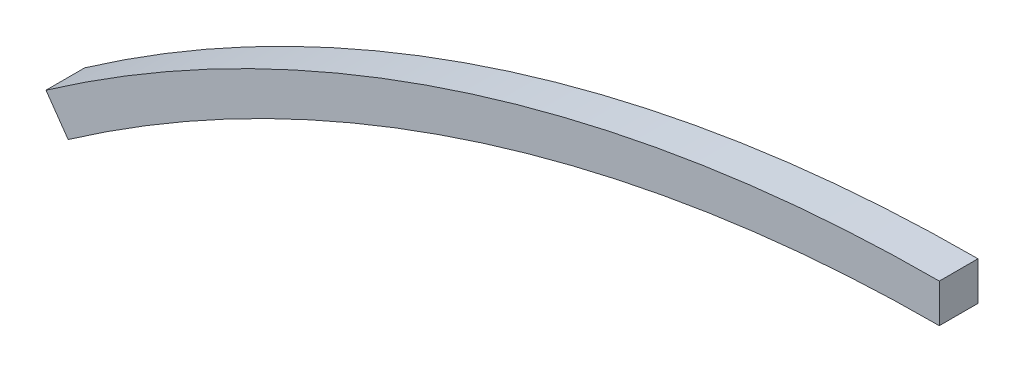
ISO-10303-21;
HEADER;
FILE_DESCRIPTION(('STEP AP214'),'2;1');
FILE_NAME('part.step','',(''),(''),'','','');
FILE_SCHEMA(('AUTOMOTIVE_DESIGN { 1 0 10303 214 1 1 1 1 }'));
ENDSEC;
DATA;
#1=APPLICATION_CONTEXT('core data for automotive mechanical design processes');
#2=APPLICATION_PROTOCOL_DEFINITION('international standard','automotive_design',2000,#1);
#3=PRODUCT_CONTEXT('',#1,'mechanical');
#4=PRODUCT('Part','Part','',(#3));
#5=PRODUCT_RELATED_PRODUCT_CATEGORY('part','',(#4));
#6=PRODUCT_DEFINITION_FORMATION('','',#4);
#7=PRODUCT_DEFINITION_CONTEXT('part definition',#1,'design');
#8=PRODUCT_DEFINITION('design','',#6,#7);
#9=PRODUCT_DEFINITION_SHAPE('','',#8);
#10=(LENGTH_UNIT() NAMED_UNIT(*) SI_UNIT(.MILLI.,.METRE.));
#11=(NAMED_UNIT(*) PLANE_ANGLE_UNIT() SI_UNIT($,.RADIAN.));
#12=(NAMED_UNIT(*) SI_UNIT($,.STERADIAN.) SOLID_ANGLE_UNIT());
#13=UNCERTAINTY_MEASURE_WITH_UNIT(LENGTH_MEASURE(1.E-05),#10,'distance_accuracy_value','');
#14=(GEOMETRIC_REPRESENTATION_CONTEXT(3) GLOBAL_UNCERTAINTY_ASSIGNED_CONTEXT((#13)) GLOBAL_UNIT_ASSIGNED_CONTEXT((#10,
#11,#12)) REPRESENTATION_CONTEXT('',''));
#15=CARTESIAN_POINT('',(0.,0.,0.));
#16=DIRECTION('',(0.,0.,1.));
#17=DIRECTION('',(1.,0.,0.));
#18=AXIS2_PLACEMENT_3D('',#15,#16,#17);
#19=CARTESIAN_POINT('',(0.,0.,2.));
#20=DIRECTION('',(0.,0.,-1.));
#21=DIRECTION('',(-1.,0.,0.));
#22=AXIS2_PLACEMENT_3D('',#19,#20,#21);
#23=CYLINDRICAL_SURFACE('',#22,78.6359913793104);
#24=CARTESIAN_POINT('',(0.,0.,0.));
#25=DIRECTION('',(0.,0.,-1.));
#26=DIRECTION('',(1.,0.,0.));
#27=AXIS2_PLACEMENT_3D('',#24,#25,#26);
#28=CIRCLE('',#27,78.6359913793104);
#29=CARTESIAN_POINT('',(-45.0615439363453,64.4443666915875,0.));
#30=VERTEX_POINT('',#29);
#31=CARTESIAN_POINT('',(0.,78.6359913793104,0.));
#32=VERTEX_POINT('',#31);
#33=EDGE_CURVE('E96',#30,#32,#28,.T.);
#34=ORIENTED_EDGE('',*,*,#33,.T.);
#35=DIRECTION('',(0.,0.,-1.));
#36=VECTOR('',#35,1.);
#37=CARTESIAN_POINT('',(0.,78.6359913793104,2.));
#38=LINE('',#37,#36);
#39=CARTESIAN_POINT('',(0.,78.6359913793104,2.));
#40=VERTEX_POINT('',#39);
#41=EDGE_CURVE('E11',#40,#32,#38,.T.);
#42=ORIENTED_EDGE('',*,*,#41,.F.);
#43=CARTESIAN_POINT('',(0.,0.,2.));
#44=DIRECTION('',(0.,0.,-1.));
#45=DIRECTION('',(1.,0.,0.));
#46=AXIS2_PLACEMENT_3D('',#43,#44,#45);
#47=CIRCLE('',#46,78.6359913793104);
#48=CARTESIAN_POINT('',(-45.0615439363453,64.4443666915875,2.));
#49=VERTEX_POINT('',#48);
#50=EDGE_CURVE('E84',#49,#40,#47,.T.);
#51=ORIENTED_EDGE('',*,*,#50,.F.);
#52=DIRECTION('',(0.,0.,-1.));
#53=VECTOR('',#52,1.);
#54=CARTESIAN_POINT('',(-45.0615439363453,64.4443666915875,2.));
#55=LINE('',#54,#53);
#56=EDGE_CURVE('E92',#49,#30,#55,.T.);
#57=ORIENTED_EDGE('',*,*,#56,.T.);
#58=EDGE_LOOP('',(#34,#42,#51,#57));
#59=FACE_BOUND('',#58,.T.);
#60=ADVANCED_FACE('F33',(#59),#23,.F.);
#61=CARTESIAN_POINT('',(0.,78.6359913793104,2.));
#62=DIRECTION('',(-1.,0.,0.));
#63=DIRECTION('',(0.,-1.,0.));
#64=AXIS2_PLACEMENT_3D('',#61,#62,#63);
#65=PLANE('',#64);
#66=DIRECTION('',(0.,1.,0.));
#67=VECTOR('',#66,1.);
#68=CARTESIAN_POINT('',(0.,78.6359913793104,0.));
#69=LINE('',#68,#67);
#70=CARTESIAN_POINT('',(0.,80.6359913793104,0.));
#71=VERTEX_POINT('',#70);
#72=EDGE_CURVE('E88',#32,#71,#69,.T.);
#73=ORIENTED_EDGE('',*,*,#72,.T.);
#74=DIRECTION('',(0.,0.,-1.));
#75=VECTOR('',#74,1.);
#76=CARTESIAN_POINT('',(0.,80.6359913793104,2.));
#77=LINE('',#76,#75);
#78=CARTESIAN_POINT('',(0.,80.6359913793104,2.));
#79=VERTEX_POINT('',#78);
#80=EDGE_CURVE('E41',#79,#71,#77,.T.);
#81=ORIENTED_EDGE('',*,*,#80,.F.);
#82=DIRECTION('',(0.,1.,0.));
#83=VECTOR('',#82,1.);
#84=CARTESIAN_POINT('',(0.,78.6359913793104,2.));
#85=LINE('',#84,#83);
#86=EDGE_CURVE('E79',#40,#79,#85,.T.);
#87=ORIENTED_EDGE('',*,*,#86,.F.);
#88=ORIENTED_EDGE('',*,*,#41,.T.);
#89=EDGE_LOOP('',(#73,#81,#87,#88));
#90=FACE_BOUND('',#89,.T.);
#91=ADVANCED_FACE('F87',(#90),#65,.F.);
#92=CARTESIAN_POINT('',(0.,0.,2.));
#93=DIRECTION('',(0.,0.,-1.));
#94=DIRECTION('',(-1.,0.,0.));
#95=AXIS2_PLACEMENT_3D('',#92,#93,#94);
#96=CYLINDRICAL_SURFACE('',#95,80.6359913793104);
#97=CARTESIAN_POINT('',(0.,0.,0.));
#98=DIRECTION('',(0.,0.,1.));
#99=DIRECTION('',(1.,0.,0.));
#100=AXIS2_PLACEMENT_3D('',#97,#98,#99);
#101=CIRCLE('',#100,80.6359913793104);
#102=CARTESIAN_POINT('',(-46.207623311602,66.0834219272679,0.));
#103=VERTEX_POINT('',#102);
#104=EDGE_CURVE('E66',#71,#103,#101,.T.);
#105=ORIENTED_EDGE('',*,*,#104,.T.);
#106=DIRECTION('',(0.,0.,-1.));
#107=VECTOR('',#106,1.);
#108=CARTESIAN_POINT('',(-46.207623311602,66.0834219272679,2.));
#109=LINE('',#108,#107);
#110=CARTESIAN_POINT('',(-46.207623311602,66.0834219272679,2.));
#111=VERTEX_POINT('',#110);
#112=EDGE_CURVE('E89',#111,#103,#109,.T.);
#113=ORIENTED_EDGE('',*,*,#112,.F.);
#114=CARTESIAN_POINT('',(0.,0.,2.));
#115=DIRECTION('',(0.,0.,1.));
#116=DIRECTION('',(1.,0.,0.));
#117=AXIS2_PLACEMENT_3D('',#114,#115,#116);
#118=CIRCLE('',#117,80.6359913793104);
#119=EDGE_CURVE('E82',#79,#111,#118,.T.);
#120=ORIENTED_EDGE('',*,*,#119,.F.);
#121=ORIENTED_EDGE('',*,*,#80,.T.);
#122=EDGE_LOOP('',(#105,#113,#120,#121));
#123=FACE_BOUND('',#122,.T.);
#124=ADVANCED_FACE('F90',(#123),#96,.T.);
#125=CARTESIAN_POINT('',(-46.207623311602,66.0834219272679,2.));
#126=DIRECTION('',(0.819527617840181,0.57303968762835,0.));
#127=DIRECTION('',(-0.57303968762835,0.819527617840181,0.));
#128=AXIS2_PLACEMENT_3D('',#125,#126,#127);
#129=PLANE('',#128);
#130=DIRECTION('',(0.57303968762835,-0.819527617840181,0.));
#131=VECTOR('',#130,1.);
#132=CARTESIAN_POINT('',(-46.207623311602,66.0834219272679,0.));
#133=LINE('',#132,#131);
#134=EDGE_CURVE('E72',#103,#30,#133,.T.);
#135=ORIENTED_EDGE('',*,*,#134,.T.);
#136=ORIENTED_EDGE('',*,*,#56,.F.);
#137=DIRECTION('',(0.57303968762835,-0.819527617840181,0.));
#138=VECTOR('',#137,1.);
#139=CARTESIAN_POINT('',(-46.207623311602,66.0834219272679,2.));
#140=LINE('',#139,#138);
#141=EDGE_CURVE('E49',#111,#49,#140,.T.);
#142=ORIENTED_EDGE('',*,*,#141,.F.);
#143=ORIENTED_EDGE('',*,*,#112,.T.);
#144=EDGE_LOOP('',(#135,#136,#142,#143));
#145=FACE_BOUND('',#144,.T.);
#146=ADVANCED_FACE('F103',(#145),#129,.F.);
#147=CARTESIAN_POINT('',(0.,0.,2.));
#148=DIRECTION('',(0.,0.,1.));
#149=DIRECTION('',(1.,0.,0.));
#150=AXIS2_PLACEMENT_3D('',#147,#148,#149);
#151=PLANE('',#150);
#152=ORIENTED_EDGE('',*,*,#50,.T.);
#153=ORIENTED_EDGE('',*,*,#86,.T.);
#154=ORIENTED_EDGE('',*,*,#119,.T.);
#155=ORIENTED_EDGE('',*,*,#141,.T.);
#156=EDGE_LOOP('',(#152,#153,#154,#155));
#157=FACE_BOUND('',#156,.T.);
#158=ADVANCED_FACE('F80',(#157),#151,.T.);
#159=CARTESIAN_POINT('',(0.,0.,0.));
#160=DIRECTION('',(0.,0.,1.));
#161=DIRECTION('',(1.,0.,0.));
#162=AXIS2_PLACEMENT_3D('',#159,#160,#161);
#163=PLANE('',#162);
#164=ORIENTED_EDGE('',*,*,#33,.F.);
#165=ORIENTED_EDGE('',*,*,#134,.F.);
#166=ORIENTED_EDGE('',*,*,#104,.F.);
#167=ORIENTED_EDGE('',*,*,#72,.F.);
#168=EDGE_LOOP('',(#164,#165,#166,#167));
#169=FACE_BOUND('',#168,.T.);
#170=ADVANCED_FACE('F106',(#169),#163,.F.);
#171=CLOSED_SHELL('',(#60,#91,#124,#146,#158,#170));
#172=MANIFOLD_SOLID_BREP('B2',#171);
#173=ADVANCED_BREP_SHAPE_REPRESENTATION('',(#18,#172),#14);
#174=SHAPE_DEFINITION_REPRESENTATION(#9,#173);
ENDSEC;
END-ISO-10303-21;
